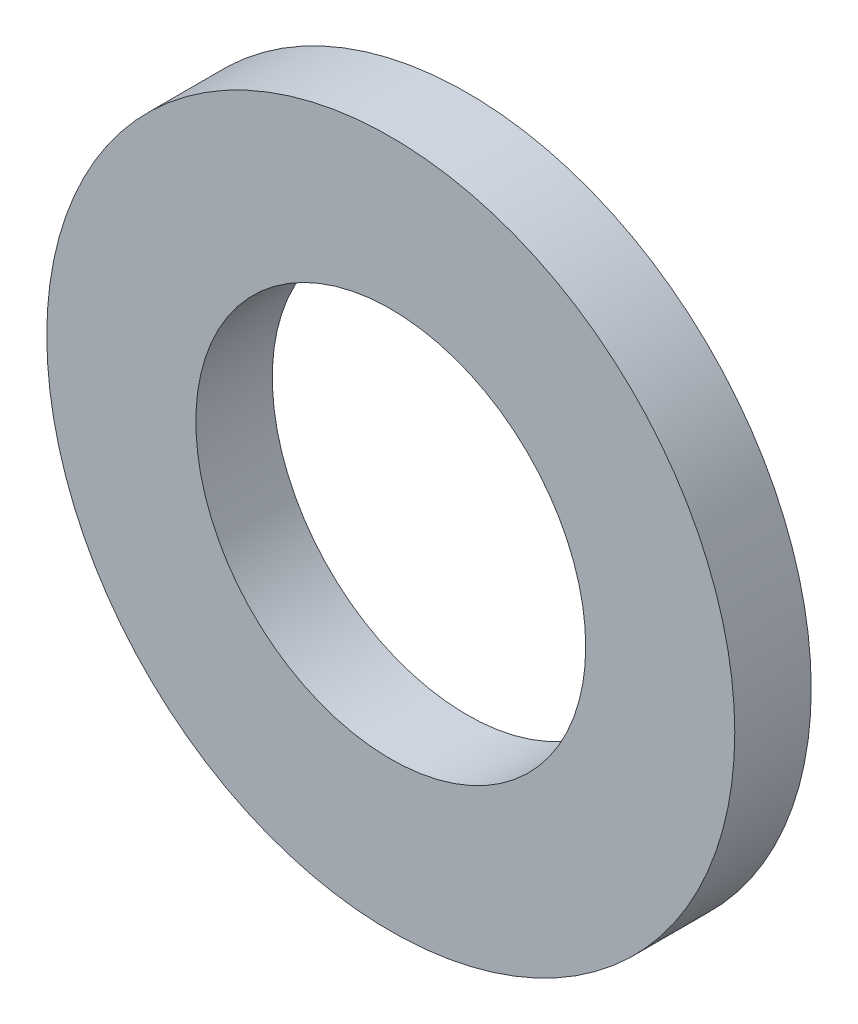
ISO-10303-21;
HEADER;
FILE_DESCRIPTION(('STEP AP214'),'2;1');
FILE_NAME('part.step','',(''),(''),'','','');
FILE_SCHEMA(('AUTOMOTIVE_DESIGN { 1 0 10303 214 1 1 1 1 }'));
ENDSEC;
DATA;
#1=APPLICATION_CONTEXT('core data for automotive mechanical design processes');
#2=APPLICATION_PROTOCOL_DEFINITION('international standard','automotive_design',2000,#1);
#3=PRODUCT_CONTEXT('',#1,'mechanical');
#4=PRODUCT('Part','Part','',(#3));
#5=PRODUCT_RELATED_PRODUCT_CATEGORY('part','',(#4));
#6=PRODUCT_DEFINITION_FORMATION('','',#4);
#7=PRODUCT_DEFINITION_CONTEXT('part definition',#1,'design');
#8=PRODUCT_DEFINITION('design','',#6,#7);
#9=PRODUCT_DEFINITION_SHAPE('','',#8);
#10=(LENGTH_UNIT() NAMED_UNIT(*) SI_UNIT(.MILLI.,.METRE.));
#11=(NAMED_UNIT(*) PLANE_ANGLE_UNIT() SI_UNIT($,.RADIAN.));
#12=(NAMED_UNIT(*) SI_UNIT($,.STERADIAN.) SOLID_ANGLE_UNIT());
#13=UNCERTAINTY_MEASURE_WITH_UNIT(LENGTH_MEASURE(1.E-05),#10,'distance_accuracy_value','');
#14=(GEOMETRIC_REPRESENTATION_CONTEXT(3) GLOBAL_UNCERTAINTY_ASSIGNED_CONTEXT((#13)) GLOBAL_UNIT_ASSIGNED_CONTEXT((#10,
#11,#12)) REPRESENTATION_CONTEXT('',''));
#15=CARTESIAN_POINT('',(0.,0.,0.));
#16=DIRECTION('',(0.,0.,1.));
#17=DIRECTION('',(1.,0.,0.));
#18=AXIS2_PLACEMENT_3D('',#15,#16,#17);
#19=CARTESIAN_POINT('',(0.,0.,2.));
#20=DIRECTION('',(0.,0.,1.));
#21=DIRECTION('',(1.,0.,0.));
#22=AXIS2_PLACEMENT_3D('',#19,#20,#21);
#23=PLANE('',#22);
#24=CARTESIAN_POINT('',(0.,0.,2.));
#25=DIRECTION('',(0.,0.,1.));
#26=DIRECTION('',(1.,0.,0.));
#27=AXIS2_PLACEMENT_3D('',#24,#25,#26);
#28=CIRCLE('',#27,9.);
#29=CARTESIAN_POINT('',(9.,0.,2.));
#30=VERTEX_POINT('',#29);
#31=EDGE_CURVE('E10',#30,#30,#28,.T.);
#32=ORIENTED_EDGE('',*,*,#31,.T.);
#33=EDGE_LOOP('',(#32));
#34=FACE_BOUND('',#33,.T.);
#35=CARTESIAN_POINT('',(0.,0.,2.));
#36=DIRECTION('',(0.,0.,1.));
#37=DIRECTION('',(1.,0.,0.));
#38=AXIS2_PLACEMENT_3D('',#35,#36,#37);
#39=CIRCLE('',#38,5.1);
#40=CARTESIAN_POINT('',(5.1,0.,2.));
#41=VERTEX_POINT('',#40);
#42=EDGE_CURVE('E41',#41,#41,#39,.T.);
#43=ORIENTED_EDGE('',*,*,#42,.F.);
#44=EDGE_LOOP('',(#43));
#45=FACE_BOUND('',#44,.T.);
#46=ADVANCED_FACE('F30',(#34,#45),#23,.T.);
#47=CARTESIAN_POINT('',(0.,0.,0.));
#48=DIRECTION('',(0.,0.,1.));
#49=DIRECTION('',(1.,0.,0.));
#50=AXIS2_PLACEMENT_3D('',#47,#48,#49);
#51=PLANE('',#50);
#52=CARTESIAN_POINT('',(0.,0.,0.));
#53=DIRECTION('',(0.,0.,1.));
#54=DIRECTION('',(1.,0.,0.));
#55=AXIS2_PLACEMENT_3D('',#52,#53,#54);
#56=CIRCLE('',#55,9.);
#57=CARTESIAN_POINT('',(9.,0.,0.));
#58=VERTEX_POINT('',#57);
#59=EDGE_CURVE('E34',#58,#58,#56,.T.);
#60=ORIENTED_EDGE('',*,*,#59,.F.);
#61=EDGE_LOOP('',(#60));
#62=FACE_BOUND('',#61,.T.);
#63=CARTESIAN_POINT('',(0.,0.,0.));
#64=DIRECTION('',(0.,0.,1.));
#65=DIRECTION('',(1.,0.,0.));
#66=AXIS2_PLACEMENT_3D('',#63,#64,#65);
#67=CIRCLE('',#66,5.1);
#68=CARTESIAN_POINT('',(5.1,0.,0.));
#69=VERTEX_POINT('',#68);
#70=EDGE_CURVE('E43',#69,#69,#67,.T.);
#71=ORIENTED_EDGE('',*,*,#70,.T.);
#72=EDGE_LOOP('',(#71));
#73=FACE_BOUND('',#72,.T.);
#74=ADVANCED_FACE('F53',(#62,#73),#51,.F.);
#75=CARTESIAN_POINT('',(0.,0.,2.));
#76=DIRECTION('',(0.,0.,-1.));
#77=DIRECTION('',(-1.,0.,0.));
#78=AXIS2_PLACEMENT_3D('',#75,#76,#77);
#79=CYLINDRICAL_SURFACE('',#78,9.);
#80=ORIENTED_EDGE('',*,*,#31,.F.);
#81=EDGE_LOOP('',(#80));
#82=FACE_BOUND('',#81,.T.);
#83=ORIENTED_EDGE('',*,*,#59,.T.);
#84=EDGE_LOOP('',(#83));
#85=FACE_BOUND('',#84,.T.);
#86=ADVANCED_FACE('F32',(#82,#85),#79,.T.);
#87=CARTESIAN_POINT('',(0.,0.,2.));
#88=DIRECTION('',(0.,0.,-1.));
#89=DIRECTION('',(-1.,0.,0.));
#90=AXIS2_PLACEMENT_3D('',#87,#88,#89);
#91=CYLINDRICAL_SURFACE('',#90,5.1);
#92=ORIENTED_EDGE('',*,*,#42,.T.);
#93=EDGE_LOOP('',(#92));
#94=FACE_BOUND('',#93,.T.);
#95=ORIENTED_EDGE('',*,*,#70,.F.);
#96=EDGE_LOOP('',(#95));
#97=FACE_BOUND('',#96,.T.);
#98=ADVANCED_FACE('F49',(#94,#97),#91,.F.);
#99=CLOSED_SHELL('',(#46,#74,#86,#98));
#100=MANIFOLD_SOLID_BREP('B2',#99);
#101=ADVANCED_BREP_SHAPE_REPRESENTATION('',(#18,#100),#14);
#102=SHAPE_DEFINITION_REPRESENTATION(#9,#101);
ENDSEC;
END-ISO-10303-21;
